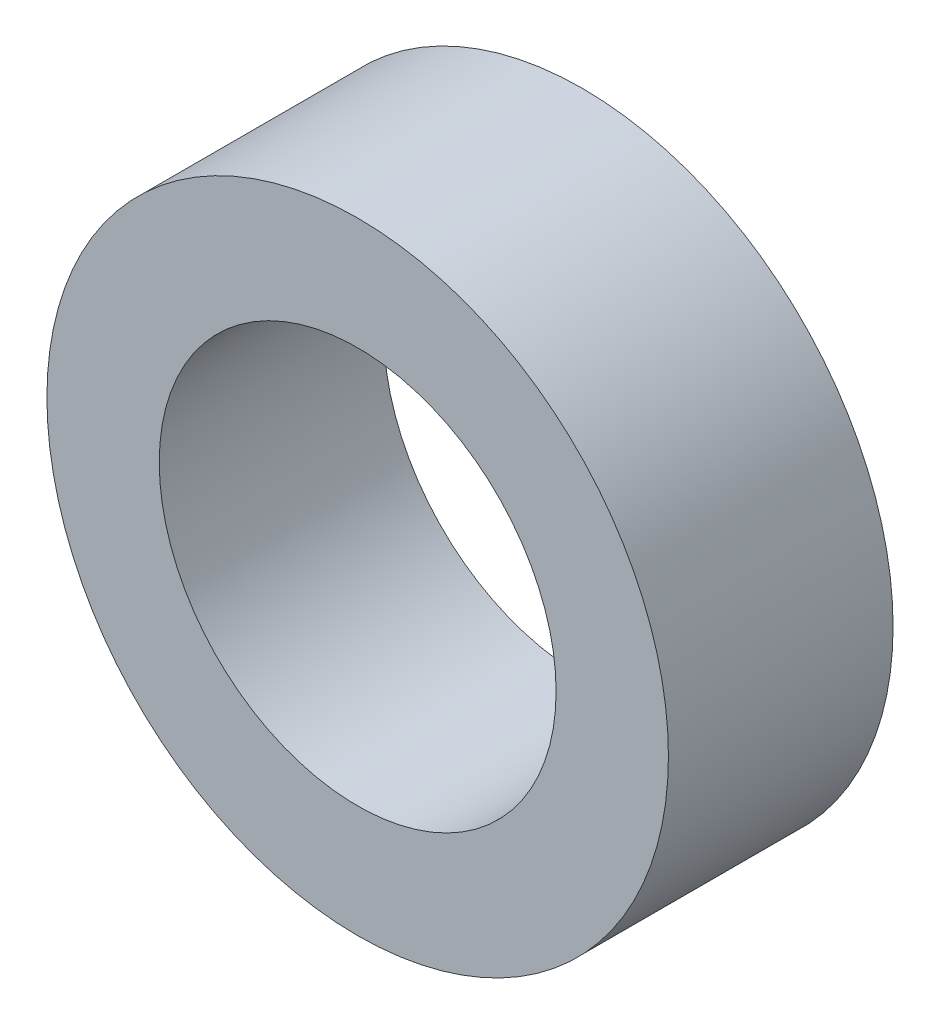
ISO-10303-21;
HEADER;
FILE_DESCRIPTION(('STEP AP214'),'2;1');
FILE_NAME('part.step','',(''),(''),'','','');
FILE_SCHEMA(('AUTOMOTIVE_DESIGN { 1 0 10303 214 1 1 1 1 }'));
ENDSEC;
DATA;
#1=APPLICATION_CONTEXT('core data for automotive mechanical design processes');
#2=APPLICATION_PROTOCOL_DEFINITION('international standard','automotive_design',2000,#1);
#3=PRODUCT_CONTEXT('',#1,'mechanical');
#4=PRODUCT('Part','Part','',(#3));
#5=PRODUCT_RELATED_PRODUCT_CATEGORY('part','',(#4));
#6=PRODUCT_DEFINITION_FORMATION('','',#4);
#7=PRODUCT_DEFINITION_CONTEXT('part definition',#1,'design');
#8=PRODUCT_DEFINITION('design','',#6,#7);
#9=PRODUCT_DEFINITION_SHAPE('','',#8);
#10=(LENGTH_UNIT() NAMED_UNIT(*) SI_UNIT(.MILLI.,.METRE.));
#11=(NAMED_UNIT(*) PLANE_ANGLE_UNIT() SI_UNIT($,.RADIAN.));
#12=(NAMED_UNIT(*) SI_UNIT($,.STERADIAN.) SOLID_ANGLE_UNIT());
#13=UNCERTAINTY_MEASURE_WITH_UNIT(LENGTH_MEASURE(1.E-05),#10,'distance_accuracy_value','');
#14=(GEOMETRIC_REPRESENTATION_CONTEXT(3) GLOBAL_UNCERTAINTY_ASSIGNED_CONTEXT((#13)) GLOBAL_UNIT_ASSIGNED_CONTEXT((#10,
#11,#12)) REPRESENTATION_CONTEXT('',''));
#15=CARTESIAN_POINT('',(0.,0.,0.));
#16=DIRECTION('',(0.,0.,1.));
#17=DIRECTION('',(1.,0.,0.));
#18=AXIS2_PLACEMENT_3D('',#15,#16,#17);
#19=CARTESIAN_POINT('',(0.,0.,3.));
#20=DIRECTION('',(0.,0.,1.));
#21=DIRECTION('',(1.,0.,0.));
#22=AXIS2_PLACEMENT_3D('',#19,#20,#21);
#23=PLANE('',#22);
#24=CARTESIAN_POINT('',(0.,0.,3.));
#25=DIRECTION('',(0.,0.,1.));
#26=DIRECTION('',(1.,0.,0.));
#27=AXIS2_PLACEMENT_3D('',#24,#25,#26);
#28=CIRCLE('',#27,4.15);
#29=CARTESIAN_POINT('',(4.15,0.,3.));
#30=VERTEX_POINT('',#29);
#31=EDGE_CURVE('E10',#30,#30,#28,.T.);
#32=ORIENTED_EDGE('',*,*,#31,.T.);
#33=EDGE_LOOP('',(#32));
#34=FACE_BOUND('',#33,.T.);
#35=CARTESIAN_POINT('',(0.,0.,3.));
#36=DIRECTION('',(0.,0.,1.));
#37=DIRECTION('',(1.,0.,0.));
#38=AXIS2_PLACEMENT_3D('',#35,#36,#37);
#39=CIRCLE('',#38,2.65);
#40=CARTESIAN_POINT('',(2.65,0.,3.));
#41=VERTEX_POINT('',#40);
#42=EDGE_CURVE('E54',#41,#41,#39,.T.);
#43=ORIENTED_EDGE('',*,*,#42,.F.);
#44=EDGE_LOOP('',(#43));
#45=FACE_BOUND('',#44,.T.);
#46=ADVANCED_FACE('F41',(#34,#45),#23,.T.);
#47=CARTESIAN_POINT('',(0.,0.,0.));
#48=DIRECTION('',(0.,0.,1.));
#49=DIRECTION('',(1.,0.,0.));
#50=AXIS2_PLACEMENT_3D('',#47,#48,#49);
#51=PLANE('',#50);
#52=CARTESIAN_POINT('',(0.,0.,0.));
#53=DIRECTION('',(0.,0.,1.));
#54=DIRECTION('',(1.,0.,0.));
#55=AXIS2_PLACEMENT_3D('',#52,#53,#54);
#56=CIRCLE('',#55,4.15);
#57=CARTESIAN_POINT('',(4.15,0.,0.));
#58=VERTEX_POINT('',#57);
#59=EDGE_CURVE('E45',#58,#58,#56,.T.);
#60=ORIENTED_EDGE('',*,*,#59,.F.);
#61=EDGE_LOOP('',(#60));
#62=FACE_BOUND('',#61,.T.);
#63=CARTESIAN_POINT('',(0.,0.,0.));
#64=DIRECTION('',(0.,0.,1.));
#65=DIRECTION('',(1.,0.,0.));
#66=AXIS2_PLACEMENT_3D('',#63,#64,#65);
#67=CIRCLE('',#66,2.65);
#68=CARTESIAN_POINT('',(2.65,0.,0.));
#69=VERTEX_POINT('',#68);
#70=EDGE_CURVE('E56',#69,#69,#67,.T.);
#71=ORIENTED_EDGE('',*,*,#70,.T.);
#72=EDGE_LOOP('',(#71));
#73=FACE_BOUND('',#72,.T.);
#74=ADVANCED_FACE('F68',(#62,#73),#51,.F.);
#75=CARTESIAN_POINT('',(0.,0.,3.));
#76=DIRECTION('',(0.,0.,-1.));
#77=DIRECTION('',(-1.,0.,0.));
#78=AXIS2_PLACEMENT_3D('',#75,#76,#77);
#79=CYLINDRICAL_SURFACE('',#78,4.15);
#80=ORIENTED_EDGE('',*,*,#31,.F.);
#81=EDGE_LOOP('',(#80));
#82=FACE_BOUND('',#81,.T.);
#83=ORIENTED_EDGE('',*,*,#59,.T.);
#84=EDGE_LOOP('',(#83));
#85=FACE_BOUND('',#84,.T.);
#86=ADVANCED_FACE('F43',(#82,#85),#79,.T.);
#87=CARTESIAN_POINT('',(0.,0.,3.));
#88=DIRECTION('',(0.,0.,-1.));
#89=DIRECTION('',(-1.,0.,0.));
#90=AXIS2_PLACEMENT_3D('',#87,#88,#89);
#91=CYLINDRICAL_SURFACE('',#90,2.65);
#92=ORIENTED_EDGE('',*,*,#42,.T.);
#93=EDGE_LOOP('',(#92));
#94=FACE_BOUND('',#93,.T.);
#95=ORIENTED_EDGE('',*,*,#70,.F.);
#96=EDGE_LOOP('',(#95));
#97=FACE_BOUND('',#96,.T.);
#98=ADVANCED_FACE('F64',(#94,#97),#91,.F.);
#99=CLOSED_SHELL('',(#46,#74,#86,#98));
#100=MANIFOLD_SOLID_BREP('B2',#99);
#101=ADVANCED_BREP_SHAPE_REPRESENTATION('',(#18,#100),#14);
#102=SHAPE_DEFINITION_REPRESENTATION(#9,#101);
ENDSEC;
END-ISO-10303-21;
